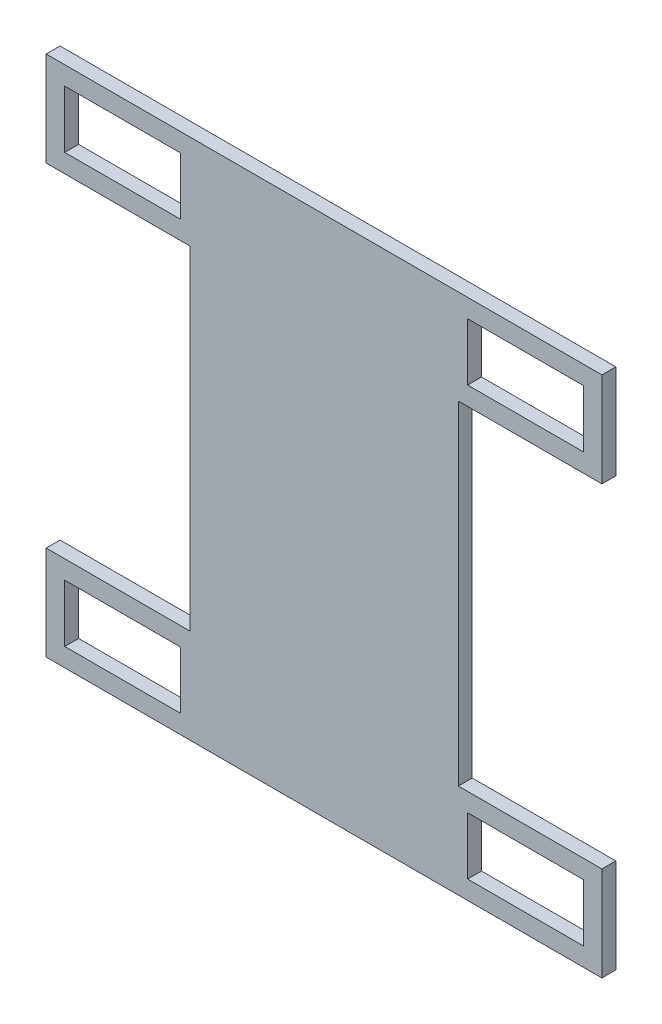
ISO-10303-21;
HEADER;
FILE_DESCRIPTION(('STEP AP214'),'2;1');
FILE_NAME('part.step','',(''),(''),'','','');
FILE_SCHEMA(('AUTOMOTIVE_DESIGN { 1 0 10303 214 1 1 1 1 }'));
ENDSEC;
DATA;
#1=APPLICATION_CONTEXT('core data for automotive mechanical design processes');
#2=APPLICATION_PROTOCOL_DEFINITION('international standard','automotive_design',2000,#1);
#3=PRODUCT_CONTEXT('',#1,'mechanical');
#4=PRODUCT('Part','Part','',(#3));
#5=PRODUCT_RELATED_PRODUCT_CATEGORY('part','',(#4));
#6=PRODUCT_DEFINITION_FORMATION('','',#4);
#7=PRODUCT_DEFINITION_CONTEXT('part definition',#1,'design');
#8=PRODUCT_DEFINITION('design','',#6,#7);
#9=PRODUCT_DEFINITION_SHAPE('','',#8);
#10=(LENGTH_UNIT() NAMED_UNIT(*) SI_UNIT(.MILLI.,.METRE.));
#11=(NAMED_UNIT(*) PLANE_ANGLE_UNIT() SI_UNIT($,.RADIAN.));
#12=(NAMED_UNIT(*) SI_UNIT($,.STERADIAN.) SOLID_ANGLE_UNIT());
#13=UNCERTAINTY_MEASURE_WITH_UNIT(LENGTH_MEASURE(1.E-05),#10,'distance_accuracy_value','');
#14=(GEOMETRIC_REPRESENTATION_CONTEXT(3) GLOBAL_UNCERTAINTY_ASSIGNED_CONTEXT((#13)) GLOBAL_UNIT_ASSIGNED_CONTEXT((#10,
#11,#12)) REPRESENTATION_CONTEXT('',''));
#15=CARTESIAN_POINT('',(0.,0.,0.));
#16=DIRECTION('',(0.,0.,1.));
#17=DIRECTION('',(1.,0.,0.));
#18=AXIS2_PLACEMENT_3D('',#15,#16,#17);
#19=CARTESIAN_POINT('',(0.,0.,3.));
#20=DIRECTION('',(0.,0.,-1.));
#21=DIRECTION('',(-1.,0.,0.));
#22=AXIS2_PLACEMENT_3D('',#19,#20,#21);
#23=PLANE('',#22);
#24=DIRECTION('',(1.,0.,0.));
#25=VECTOR('',#24,1.);
#26=CARTESIAN_POINT('',(-31.,-52.4,3.));
#27=LINE('',#26,#25);
#28=CARTESIAN_POINT('',(-56.,-52.4,3.));
#29=VERTEX_POINT('',#28);
#30=CARTESIAN_POINT('',(-31.,-52.4,3.));
#31=VERTEX_POINT('',#30);
#32=EDGE_CURVE('E256',#29,#31,#27,.T.);
#33=ORIENTED_EDGE('',*,*,#32,.F.);
#34=DIRECTION('',(0.,-1.,0.));
#35=VECTOR('',#34,1.);
#36=CARTESIAN_POINT('',(-56.,-52.4,3.));
#37=LINE('',#36,#35);
#38=CARTESIAN_POINT('',(-56.,-40.,3.));
#39=VERTEX_POINT('',#38);
#40=EDGE_CURVE('E264',#39,#29,#37,.T.);
#41=ORIENTED_EDGE('',*,*,#40,.F.);
#42=DIRECTION('',(-1.,0.,0.));
#43=VECTOR('',#42,1.);
#44=CARTESIAN_POINT('',(-31.,-40.,3.));
#45=LINE('',#44,#43);
#46=CARTESIAN_POINT('',(-31.,-40.,3.));
#47=VERTEX_POINT('',#46);
#48=EDGE_CURVE('E261',#47,#39,#45,.T.);
#49=ORIENTED_EDGE('',*,*,#48,.F.);
#50=DIRECTION('',(0.,1.,0.));
#51=VECTOR('',#50,1.);
#52=CARTESIAN_POINT('',(-31.,-52.4,3.));
#53=LINE('',#52,#51);
#54=EDGE_CURVE('E258',#31,#47,#53,.T.);
#55=ORIENTED_EDGE('',*,*,#54,.F.);
#56=EDGE_LOOP('',(#33,#41,#49,#55));
#57=FACE_BOUND('',#56,.T.);
#58=DIRECTION('',(0.,1.,0.));
#59=VECTOR('',#58,1.);
#60=CARTESIAN_POINT('',(56.,52.4,3.));
#61=LINE('',#60,#59);
#62=CARTESIAN_POINT('',(56.,40.,3.));
#63=VERTEX_POINT('',#62);
#64=CARTESIAN_POINT('',(56.,52.4,3.));
#65=VERTEX_POINT('',#64);
#66=EDGE_CURVE('E318',#63,#65,#61,.T.);
#67=ORIENTED_EDGE('',*,*,#66,.F.);
#68=DIRECTION('',(1.,0.,0.));
#69=VECTOR('',#68,1.);
#70=CARTESIAN_POINT('',(31.,40.,3.));
#71=LINE('',#70,#69);
#72=CARTESIAN_POINT('',(31.,40.,3.));
#73=VERTEX_POINT('',#72);
#74=EDGE_CURVE('E326',#73,#63,#71,.T.);
#75=ORIENTED_EDGE('',*,*,#74,.F.);
#76=DIRECTION('',(0.,-1.,0.));
#77=VECTOR('',#76,1.);
#78=CARTESIAN_POINT('',(31.,52.4,3.));
#79=LINE('',#78,#77);
#80=CARTESIAN_POINT('',(31.,52.4,3.));
#81=VERTEX_POINT('',#80);
#82=EDGE_CURVE('E323',#81,#73,#79,.T.);
#83=ORIENTED_EDGE('',*,*,#82,.F.);
#84=DIRECTION('',(-1.,0.,0.));
#85=VECTOR('',#84,1.);
#86=CARTESIAN_POINT('',(31.,52.4,3.));
#87=LINE('',#86,#85);
#88=EDGE_CURVE('E320',#65,#81,#87,.T.);
#89=ORIENTED_EDGE('',*,*,#88,.F.);
#90=EDGE_LOOP('',(#67,#75,#83,#89));
#91=FACE_BOUND('',#90,.T.);
#92=DIRECTION('',(0.,1.,0.));
#93=VECTOR('',#92,1.);
#94=CARTESIAN_POINT('',(60.,56.4,3.));
#95=LINE('',#94,#93);
#96=CARTESIAN_POINT('',(60.,36.,3.));
#97=VERTEX_POINT('',#96);
#98=CARTESIAN_POINT('',(60.,56.4,3.));
#99=VERTEX_POINT('',#98);
#100=EDGE_CURVE('E349',#97,#99,#95,.T.);
#101=ORIENTED_EDGE('',*,*,#100,.T.);
#102=DIRECTION('',(-1.,0.,0.));
#103=VECTOR('',#102,1.);
#104=CARTESIAN_POINT('',(-60.,56.4,3.));
#105=LINE('',#104,#103);
#106=CARTESIAN_POINT('',(-60.,56.4,3.));
#107=VERTEX_POINT('',#106);
#108=EDGE_CURVE('E352',#99,#107,#105,.T.);
#109=ORIENTED_EDGE('',*,*,#108,.T.);
#110=DIRECTION('',(0.,-1.,0.));
#111=VECTOR('',#110,1.);
#112=CARTESIAN_POINT('',(-60.,56.4,3.));
#113=LINE('',#112,#111);
#114=CARTESIAN_POINT('',(-60.,36.,3.));
#115=VERTEX_POINT('',#114);
#116=EDGE_CURVE('E355',#107,#115,#113,.T.);
#117=ORIENTED_EDGE('',*,*,#116,.T.);
#118=DIRECTION('',(1.,0.,0.));
#119=VECTOR('',#118,1.);
#120=CARTESIAN_POINT('',(-60.,36.,3.));
#121=LINE('',#120,#119);
#122=CARTESIAN_POINT('',(-29.,36.,3.));
#123=VERTEX_POINT('',#122);
#124=EDGE_CURVE('E357',#115,#123,#121,.T.);
#125=ORIENTED_EDGE('',*,*,#124,.T.);
#126=DIRECTION('',(0.,-1.,0.));
#127=VECTOR('',#126,1.);
#128=CARTESIAN_POINT('',(-29.,36.,3.));
#129=LINE('',#128,#127);
#130=CARTESIAN_POINT('',(-29.,-36.,3.));
#131=VERTEX_POINT('',#130);
#132=EDGE_CURVE('E359',#123,#131,#129,.T.);
#133=ORIENTED_EDGE('',*,*,#132,.T.);
#134=DIRECTION('',(-1.,0.,0.));
#135=VECTOR('',#134,1.);
#136=CARTESIAN_POINT('',(-29.,-36.,3.));
#137=LINE('',#136,#135);
#138=CARTESIAN_POINT('',(-60.,-36.,3.));
#139=VERTEX_POINT('',#138);
#140=EDGE_CURVE('E361',#131,#139,#137,.T.);
#141=ORIENTED_EDGE('',*,*,#140,.T.);
#142=DIRECTION('',(0.,-1.,0.));
#143=VECTOR('',#142,1.);
#144=CARTESIAN_POINT('',(-60.,-36.,3.));
#145=LINE('',#144,#143);
#146=CARTESIAN_POINT('',(-60.,-56.4,3.));
#147=VERTEX_POINT('',#146);
#148=EDGE_CURVE('E363',#139,#147,#145,.T.);
#149=ORIENTED_EDGE('',*,*,#148,.T.);
#150=DIRECTION('',(1.,0.,0.));
#151=VECTOR('',#150,1.);
#152=CARTESIAN_POINT('',(60.,-56.4,3.));
#153=LINE('',#152,#151);
#154=CARTESIAN_POINT('',(60.,-56.4,3.));
#155=VERTEX_POINT('',#154);
#156=EDGE_CURVE('E365',#147,#155,#153,.T.);
#157=ORIENTED_EDGE('',*,*,#156,.T.);
#158=DIRECTION('',(0.,1.,0.));
#159=VECTOR('',#158,1.);
#160=CARTESIAN_POINT('',(60.,-36.,3.));
#161=LINE('',#160,#159);
#162=CARTESIAN_POINT('',(60.,-36.,3.));
#163=VERTEX_POINT('',#162);
#164=EDGE_CURVE('E367',#155,#163,#161,.T.);
#165=ORIENTED_EDGE('',*,*,#164,.T.);
#166=DIRECTION('',(-1.,0.,0.));
#167=VECTOR('',#166,1.);
#168=CARTESIAN_POINT('',(29.,-36.,3.));
#169=LINE('',#168,#167);
#170=CARTESIAN_POINT('',(29.,-36.,3.));
#171=VERTEX_POINT('',#170);
#172=EDGE_CURVE('E369',#163,#171,#169,.T.);
#173=ORIENTED_EDGE('',*,*,#172,.T.);
#174=DIRECTION('',(0.,1.,0.));
#175=VECTOR('',#174,1.);
#176=CARTESIAN_POINT('',(29.,36.,3.));
#177=LINE('',#176,#175);
#178=CARTESIAN_POINT('',(29.,36.,3.));
#179=VERTEX_POINT('',#178);
#180=EDGE_CURVE('E371',#171,#179,#177,.T.);
#181=ORIENTED_EDGE('',*,*,#180,.T.);
#182=DIRECTION('',(1.,0.,0.));
#183=VECTOR('',#182,1.);
#184=CARTESIAN_POINT('',(60.,36.,3.));
#185=LINE('',#184,#183);
#186=EDGE_CURVE('E373',#179,#97,#185,.T.);
#187=ORIENTED_EDGE('',*,*,#186,.T.);
#188=EDGE_LOOP('',(#101,#109,#117,#125,#133,#141,#149,#157,#165,#173,#181,#187));
#189=FACE_BOUND('',#188,.T.);
#190=DIRECTION('',(0.,-1.,0.));
#191=VECTOR('',#190,1.);
#192=CARTESIAN_POINT('',(31.,-52.4,3.));
#193=LINE('',#192,#191);
#194=CARTESIAN_POINT('',(31.,-40.,3.));
#195=VERTEX_POINT('',#194);
#196=CARTESIAN_POINT('',(31.,-52.4,3.));
#197=VERTEX_POINT('',#196);
#198=EDGE_CURVE('E287',#195,#197,#193,.T.);
#199=ORIENTED_EDGE('',*,*,#198,.F.);
#200=DIRECTION('',(-1.,0.,0.));
#201=VECTOR('',#200,1.);
#202=CARTESIAN_POINT('',(31.,-40.,3.));
#203=LINE('',#202,#201);
#204=CARTESIAN_POINT('',(56.,-40.,3.));
#205=VERTEX_POINT('',#204);
#206=EDGE_CURVE('E295',#205,#195,#203,.T.);
#207=ORIENTED_EDGE('',*,*,#206,.F.);
#208=DIRECTION('',(0.,1.,0.));
#209=VECTOR('',#208,1.);
#210=CARTESIAN_POINT('',(56.,-52.4,3.));
#211=LINE('',#210,#209);
#212=CARTESIAN_POINT('',(56.,-52.4,3.));
#213=VERTEX_POINT('',#212);
#214=EDGE_CURVE('E292',#213,#205,#211,.T.);
#215=ORIENTED_EDGE('',*,*,#214,.F.);
#216=DIRECTION('',(1.,0.,0.));
#217=VECTOR('',#216,1.);
#218=CARTESIAN_POINT('',(31.,-52.4,3.));
#219=LINE('',#218,#217);
#220=EDGE_CURVE('E289',#197,#213,#219,.T.);
#221=ORIENTED_EDGE('',*,*,#220,.F.);
#222=EDGE_LOOP('',(#199,#207,#215,#221));
#223=FACE_BOUND('',#222,.T.);
#224=DIRECTION('',(0.,1.,0.));
#225=VECTOR('',#224,1.);
#226=CARTESIAN_POINT('',(-31.,52.4,3.));
#227=LINE('',#226,#225);
#228=CARTESIAN_POINT('',(-31.,40.,3.));
#229=VERTEX_POINT('',#228);
#230=CARTESIAN_POINT('',(-31.,52.4,3.));
#231=VERTEX_POINT('',#230);
#232=EDGE_CURVE('E220',#229,#231,#227,.T.);
#233=ORIENTED_EDGE('',*,*,#232,.F.);
#234=DIRECTION('',(1.,0.,0.));
#235=VECTOR('',#234,1.);
#236=CARTESIAN_POINT('',(-31.,40.,3.));
#237=LINE('',#236,#235);
#238=CARTESIAN_POINT('',(-56.,40.,3.));
#239=VERTEX_POINT('',#238);
#240=EDGE_CURVE('E242',#239,#229,#237,.T.);
#241=ORIENTED_EDGE('',*,*,#240,.F.);
#242=DIRECTION('',(0.,-1.,0.));
#243=VECTOR('',#242,1.);
#244=CARTESIAN_POINT('',(-56.,52.4,3.));
#245=LINE('',#244,#243);
#246=CARTESIAN_POINT('',(-56.,52.4,3.));
#247=VERTEX_POINT('',#246);
#248=EDGE_CURVE('E240',#247,#239,#245,.T.);
#249=ORIENTED_EDGE('',*,*,#248,.F.);
#250=DIRECTION('',(-1.,0.,0.));
#251=VECTOR('',#250,1.);
#252=CARTESIAN_POINT('',(-31.,52.4,3.));
#253=LINE('',#252,#251);
#254=EDGE_CURVE('E228',#231,#247,#253,.T.);
#255=ORIENTED_EDGE('',*,*,#254,.F.);
#256=EDGE_LOOP('',(#233,#241,#249,#255));
#257=FACE_BOUND('',#256,.T.);
#258=ADVANCED_FACE('F35',(#57,#91,#189,#223,#257),#23,.F.);
#259=CARTESIAN_POINT('',(0.,0.,0.));
#260=DIRECTION('',(0.,0.,-1.));
#261=DIRECTION('',(-1.,0.,0.));
#262=AXIS2_PLACEMENT_3D('',#259,#260,#261);
#263=PLANE('',#262);
#264=DIRECTION('',(0.,1.,0.));
#265=VECTOR('',#264,1.);
#266=CARTESIAN_POINT('',(60.,56.4,0.));
#267=LINE('',#266,#265);
#268=CARTESIAN_POINT('',(60.,36.,0.));
#269=VERTEX_POINT('',#268);
#270=CARTESIAN_POINT('',(60.,56.4,0.));
#271=VERTEX_POINT('',#270);
#272=EDGE_CURVE('E348',#269,#271,#267,.T.);
#273=ORIENTED_EDGE('',*,*,#272,.F.);
#274=DIRECTION('',(1.,0.,0.));
#275=VECTOR('',#274,1.);
#276=CARTESIAN_POINT('',(60.,36.,0.));
#277=LINE('',#276,#275);
#278=CARTESIAN_POINT('',(29.,36.,0.));
#279=VERTEX_POINT('',#278);
#280=EDGE_CURVE('E353',#279,#269,#277,.T.);
#281=ORIENTED_EDGE('',*,*,#280,.F.);
#282=DIRECTION('',(0.,1.,0.));
#283=VECTOR('',#282,1.);
#284=CARTESIAN_POINT('',(29.,36.,0.));
#285=LINE('',#284,#283);
#286=CARTESIAN_POINT('',(29.,-36.,0.));
#287=VERTEX_POINT('',#286);
#288=EDGE_CURVE('E396',#287,#279,#285,.T.);
#289=ORIENTED_EDGE('',*,*,#288,.F.);
#290=DIRECTION('',(-1.,0.,0.));
#291=VECTOR('',#290,1.);
#292=CARTESIAN_POINT('',(29.,-36.,0.));
#293=LINE('',#292,#291);
#294=CARTESIAN_POINT('',(60.,-36.,0.));
#295=VERTEX_POINT('',#294);
#296=EDGE_CURVE('E394',#295,#287,#293,.T.);
#297=ORIENTED_EDGE('',*,*,#296,.F.);
#298=DIRECTION('',(0.,1.,0.));
#299=VECTOR('',#298,1.);
#300=CARTESIAN_POINT('',(60.,-36.,0.));
#301=LINE('',#300,#299);
#302=CARTESIAN_POINT('',(60.,-56.4,0.));
#303=VERTEX_POINT('',#302);
#304=EDGE_CURVE('E392',#303,#295,#301,.T.);
#305=ORIENTED_EDGE('',*,*,#304,.F.);
#306=DIRECTION('',(1.,0.,0.));
#307=VECTOR('',#306,1.);
#308=CARTESIAN_POINT('',(60.,-56.4,0.));
#309=LINE('',#308,#307);
#310=CARTESIAN_POINT('',(-60.,-56.4,0.));
#311=VERTEX_POINT('',#310);
#312=EDGE_CURVE('E390',#311,#303,#309,.T.);
#313=ORIENTED_EDGE('',*,*,#312,.F.);
#314=DIRECTION('',(0.,-1.,0.));
#315=VECTOR('',#314,1.);
#316=CARTESIAN_POINT('',(-60.,-36.,0.));
#317=LINE('',#316,#315);
#318=CARTESIAN_POINT('',(-60.,-36.,0.));
#319=VERTEX_POINT('',#318);
#320=EDGE_CURVE('E388',#319,#311,#317,.T.);
#321=ORIENTED_EDGE('',*,*,#320,.F.);
#322=DIRECTION('',(-1.,0.,0.));
#323=VECTOR('',#322,1.);
#324=CARTESIAN_POINT('',(-29.,-36.,0.));
#325=LINE('',#324,#323);
#326=CARTESIAN_POINT('',(-29.,-36.,0.));
#327=VERTEX_POINT('',#326);
#328=EDGE_CURVE('E386',#327,#319,#325,.T.);
#329=ORIENTED_EDGE('',*,*,#328,.F.);
#330=DIRECTION('',(0.,-1.,0.));
#331=VECTOR('',#330,1.);
#332=CARTESIAN_POINT('',(-29.,36.,0.));
#333=LINE('',#332,#331);
#334=CARTESIAN_POINT('',(-29.,36.,0.));
#335=VERTEX_POINT('',#334);
#336=EDGE_CURVE('E384',#335,#327,#333,.T.);
#337=ORIENTED_EDGE('',*,*,#336,.F.);
#338=DIRECTION('',(1.,0.,0.));
#339=VECTOR('',#338,1.);
#340=CARTESIAN_POINT('',(-60.,36.,0.));
#341=LINE('',#340,#339);
#342=CARTESIAN_POINT('',(-60.,36.,0.));
#343=VERTEX_POINT('',#342);
#344=EDGE_CURVE('E382',#343,#335,#341,.T.);
#345=ORIENTED_EDGE('',*,*,#344,.F.);
#346=DIRECTION('',(0.,-1.,0.));
#347=VECTOR('',#346,1.);
#348=CARTESIAN_POINT('',(-60.,56.4,0.));
#349=LINE('',#348,#347);
#350=CARTESIAN_POINT('',(-60.,56.4,0.));
#351=VERTEX_POINT('',#350);
#352=EDGE_CURVE('E380',#351,#343,#349,.T.);
#353=ORIENTED_EDGE('',*,*,#352,.F.);
#354=DIRECTION('',(-1.,0.,0.));
#355=VECTOR('',#354,1.);
#356=CARTESIAN_POINT('',(-60.,56.4,0.));
#357=LINE('',#356,#355);
#358=EDGE_CURVE('E378',#271,#351,#357,.T.);
#359=ORIENTED_EDGE('',*,*,#358,.F.);
#360=EDGE_LOOP('',(#273,#281,#289,#297,#305,#313,#321,#329,#337,#345,#353,#359));
#361=FACE_BOUND('',#360,.T.);
#362=DIRECTION('',(1.,0.,0.));
#363=VECTOR('',#362,1.);
#364=CARTESIAN_POINT('',(31.,40.,0.));
#365=LINE('',#364,#363);
#366=CARTESIAN_POINT('',(31.,40.,0.));
#367=VERTEX_POINT('',#366);
#368=CARTESIAN_POINT('',(56.,40.,0.));
#369=VERTEX_POINT('',#368);
#370=EDGE_CURVE('E321',#367,#369,#365,.T.);
#371=ORIENTED_EDGE('',*,*,#370,.T.);
#372=DIRECTION('',(0.,1.,0.));
#373=VECTOR('',#372,1.);
#374=CARTESIAN_POINT('',(56.,52.4,0.));
#375=LINE('',#374,#373);
#376=CARTESIAN_POINT('',(56.,52.4,0.));
#377=VERTEX_POINT('',#376);
#378=EDGE_CURVE('E317',#369,#377,#375,.T.);
#379=ORIENTED_EDGE('',*,*,#378,.T.);
#380=DIRECTION('',(-1.,0.,0.));
#381=VECTOR('',#380,1.);
#382=CARTESIAN_POINT('',(31.,52.4,0.));
#383=LINE('',#382,#381);
#384=CARTESIAN_POINT('',(31.,52.4,0.));
#385=VERTEX_POINT('',#384);
#386=EDGE_CURVE('E331',#377,#385,#383,.T.);
#387=ORIENTED_EDGE('',*,*,#386,.T.);
#388=DIRECTION('',(0.,-1.,0.));
#389=VECTOR('',#388,1.);
#390=CARTESIAN_POINT('',(31.,52.4,0.));
#391=LINE('',#390,#389);
#392=EDGE_CURVE('E334',#385,#367,#391,.T.);
#393=ORIENTED_EDGE('',*,*,#392,.T.);
#394=EDGE_LOOP('',(#371,#379,#387,#393));
#395=FACE_BOUND('',#394,.T.);
#396=DIRECTION('',(-1.,0.,0.));
#397=VECTOR('',#396,1.);
#398=CARTESIAN_POINT('',(31.,-40.,0.));
#399=LINE('',#398,#397);
#400=CARTESIAN_POINT('',(56.,-40.,0.));
#401=VERTEX_POINT('',#400);
#402=CARTESIAN_POINT('',(31.,-40.,0.));
#403=VERTEX_POINT('',#402);
#404=EDGE_CURVE('E290',#401,#403,#399,.T.);
#405=ORIENTED_EDGE('',*,*,#404,.T.);
#406=DIRECTION('',(0.,-1.,0.));
#407=VECTOR('',#406,1.);
#408=CARTESIAN_POINT('',(31.,-52.4,0.));
#409=LINE('',#408,#407);
#410=CARTESIAN_POINT('',(31.,-52.4,0.));
#411=VERTEX_POINT('',#410);
#412=EDGE_CURVE('E286',#403,#411,#409,.T.);
#413=ORIENTED_EDGE('',*,*,#412,.T.);
#414=DIRECTION('',(1.,0.,0.));
#415=VECTOR('',#414,1.);
#416=CARTESIAN_POINT('',(31.,-52.4,0.));
#417=LINE('',#416,#415);
#418=CARTESIAN_POINT('',(56.,-52.4,0.));
#419=VERTEX_POINT('',#418);
#420=EDGE_CURVE('E300',#411,#419,#417,.T.);
#421=ORIENTED_EDGE('',*,*,#420,.T.);
#422=DIRECTION('',(0.,1.,0.));
#423=VECTOR('',#422,1.);
#424=CARTESIAN_POINT('',(56.,-52.4,0.));
#425=LINE('',#424,#423);
#426=EDGE_CURVE('E303',#419,#401,#425,.T.);
#427=ORIENTED_EDGE('',*,*,#426,.T.);
#428=EDGE_LOOP('',(#405,#413,#421,#427));
#429=FACE_BOUND('',#428,.T.);
#430=DIRECTION('',(0.,-1.,0.));
#431=VECTOR('',#430,1.);
#432=CARTESIAN_POINT('',(-56.,-52.4,0.));
#433=LINE('',#432,#431);
#434=CARTESIAN_POINT('',(-56.,-40.,0.));
#435=VERTEX_POINT('',#434);
#436=CARTESIAN_POINT('',(-56.,-52.4,0.));
#437=VERTEX_POINT('',#436);
#438=EDGE_CURVE('E259',#435,#437,#433,.T.);
#439=ORIENTED_EDGE('',*,*,#438,.T.);
#440=DIRECTION('',(1.,0.,0.));
#441=VECTOR('',#440,1.);
#442=CARTESIAN_POINT('',(-31.,-52.4,0.));
#443=LINE('',#442,#441);
#444=CARTESIAN_POINT('',(-31.,-52.4,0.));
#445=VERTEX_POINT('',#444);
#446=EDGE_CURVE('E236',#437,#445,#443,.T.);
#447=ORIENTED_EDGE('',*,*,#446,.T.);
#448=DIRECTION('',(0.,1.,0.));
#449=VECTOR('',#448,1.);
#450=CARTESIAN_POINT('',(-31.,-52.4,0.));
#451=LINE('',#450,#449);
#452=CARTESIAN_POINT('',(-31.,-40.,0.));
#453=VERTEX_POINT('',#452);
#454=EDGE_CURVE('E269',#445,#453,#451,.T.);
#455=ORIENTED_EDGE('',*,*,#454,.T.);
#456=DIRECTION('',(-1.,0.,0.));
#457=VECTOR('',#456,1.);
#458=CARTESIAN_POINT('',(-31.,-40.,0.));
#459=LINE('',#458,#457);
#460=EDGE_CURVE('E272',#453,#435,#459,.T.);
#461=ORIENTED_EDGE('',*,*,#460,.T.);
#462=EDGE_LOOP('',(#439,#447,#455,#461));
#463=FACE_BOUND('',#462,.T.);
#464=DIRECTION('',(1.,0.,0.));
#465=VECTOR('',#464,1.);
#466=CARTESIAN_POINT('',(-31.,40.,0.));
#467=LINE('',#466,#465);
#468=CARTESIAN_POINT('',(-56.,40.,0.));
#469=VERTEX_POINT('',#468);
#470=CARTESIAN_POINT('',(-31.,40.,0.));
#471=VERTEX_POINT('',#470);
#472=EDGE_CURVE('E229',#469,#471,#467,.T.);
#473=ORIENTED_EDGE('',*,*,#472,.T.);
#474=DIRECTION('',(0.,1.,0.));
#475=VECTOR('',#474,1.);
#476=CARTESIAN_POINT('',(-31.,52.4,0.));
#477=LINE('',#476,#475);
#478=CARTESIAN_POINT('',(-31.,52.4,0.));
#479=VERTEX_POINT('',#478);
#480=EDGE_CURVE('E58',#471,#479,#477,.T.);
#481=ORIENTED_EDGE('',*,*,#480,.T.);
#482=DIRECTION('',(-1.,0.,0.));
#483=VECTOR('',#482,1.);
#484=CARTESIAN_POINT('',(-31.,52.4,0.));
#485=LINE('',#484,#483);
#486=CARTESIAN_POINT('',(-56.,52.4,0.));
#487=VERTEX_POINT('',#486);
#488=EDGE_CURVE('E235',#479,#487,#485,.T.);
#489=ORIENTED_EDGE('',*,*,#488,.T.);
#490=DIRECTION('',(0.,-1.,0.));
#491=VECTOR('',#490,1.);
#492=CARTESIAN_POINT('',(-56.,52.4,0.));
#493=LINE('',#492,#491);
#494=EDGE_CURVE('E248',#487,#469,#493,.T.);
#495=ORIENTED_EDGE('',*,*,#494,.T.);
#496=EDGE_LOOP('',(#473,#481,#489,#495));
#497=FACE_BOUND('',#496,.T.);
#498=ADVANCED_FACE('F438',(#361,#395,#429,#463,#497),#263,.T.);
#499=CARTESIAN_POINT('',(60.,56.4,3.));
#500=DIRECTION('',(-1.,0.,0.));
#501=DIRECTION('',(0.,0.,1.));
#502=AXIS2_PLACEMENT_3D('',#499,#500,#501);
#503=PLANE('',#502);
#504=ORIENTED_EDGE('',*,*,#272,.T.);
#505=DIRECTION('',(0.,0.,-1.));
#506=VECTOR('',#505,1.);
#507=CARTESIAN_POINT('',(60.,56.4,3.));
#508=LINE('',#507,#506);
#509=EDGE_CURVE('E11',#99,#271,#508,.T.);
#510=ORIENTED_EDGE('',*,*,#509,.F.);
#511=ORIENTED_EDGE('',*,*,#100,.F.);
#512=DIRECTION('',(0.,0.,-1.));
#513=VECTOR('',#512,1.);
#514=CARTESIAN_POINT('',(60.,36.,3.));
#515=LINE('',#514,#513);
#516=EDGE_CURVE('E375',#97,#269,#515,.T.);
#517=ORIENTED_EDGE('',*,*,#516,.T.);
#518=EDGE_LOOP('',(#504,#510,#511,#517));
#519=FACE_BOUND('',#518,.T.);
#520=ADVANCED_FACE('F37',(#519),#503,.F.);
#521=CARTESIAN_POINT('',(-60.,56.4,3.));
#522=DIRECTION('',(0.,-1.,0.));
#523=DIRECTION('',(0.,0.,-1.));
#524=AXIS2_PLACEMENT_3D('',#521,#522,#523);
#525=PLANE('',#524);
#526=ORIENTED_EDGE('',*,*,#358,.T.);
#527=DIRECTION('',(0.,0.,-1.));
#528=VECTOR('',#527,1.);
#529=CARTESIAN_POINT('',(-60.,56.4,3.));
#530=LINE('',#529,#528);
#531=EDGE_CURVE('E43',#107,#351,#530,.T.);
#532=ORIENTED_EDGE('',*,*,#531,.F.);
#533=ORIENTED_EDGE('',*,*,#108,.F.);
#534=ORIENTED_EDGE('',*,*,#509,.T.);
#535=EDGE_LOOP('',(#526,#532,#533,#534));
#536=FACE_BOUND('',#535,.T.);
#537=ADVANCED_FACE('F456',(#536),#525,.F.);
#538=CARTESIAN_POINT('',(-60.,56.4,3.));
#539=DIRECTION('',(1.,0.,0.));
#540=DIRECTION('',(0.,0.,-1.));
#541=AXIS2_PLACEMENT_3D('',#538,#539,#540);
#542=PLANE('',#541);
#543=ORIENTED_EDGE('',*,*,#352,.T.);
#544=DIRECTION('',(0.,0.,-1.));
#545=VECTOR('',#544,1.);
#546=CARTESIAN_POINT('',(-60.,36.,3.));
#547=LINE('',#546,#545);
#548=EDGE_CURVE('E425',#115,#343,#547,.T.);
#549=ORIENTED_EDGE('',*,*,#548,.F.);
#550=ORIENTED_EDGE('',*,*,#116,.F.);
#551=ORIENTED_EDGE('',*,*,#531,.T.);
#552=EDGE_LOOP('',(#543,#549,#550,#551));
#553=FACE_BOUND('',#552,.T.);
#554=ADVANCED_FACE('F432',(#553),#542,.F.);
#555=CARTESIAN_POINT('',(-60.,36.,3.));
#556=DIRECTION('',(0.,1.,0.));
#557=DIRECTION('',(0.,0.,1.));
#558=AXIS2_PLACEMENT_3D('',#555,#556,#557);
#559=PLANE('',#558);
#560=ORIENTED_EDGE('',*,*,#344,.T.);
#561=DIRECTION('',(0.,0.,-1.));
#562=VECTOR('',#561,1.);
#563=CARTESIAN_POINT('',(-29.,36.,3.));
#564=LINE('',#563,#562);
#565=EDGE_CURVE('E422',#123,#335,#564,.T.);
#566=ORIENTED_EDGE('',*,*,#565,.F.);
#567=ORIENTED_EDGE('',*,*,#124,.F.);
#568=ORIENTED_EDGE('',*,*,#548,.T.);
#569=EDGE_LOOP('',(#560,#566,#567,#568));
#570=FACE_BOUND('',#569,.T.);
#571=ADVANCED_FACE('F444',(#570),#559,.F.);
#572=CARTESIAN_POINT('',(-29.,36.,3.));
#573=DIRECTION('',(1.,0.,0.));
#574=DIRECTION('',(0.,1.,0.));
#575=AXIS2_PLACEMENT_3D('',#572,#573,#574);
#576=PLANE('',#575);
#577=ORIENTED_EDGE('',*,*,#336,.T.);
#578=DIRECTION('',(0.,0.,-1.));
#579=VECTOR('',#578,1.);
#580=CARTESIAN_POINT('',(-29.,-36.,3.));
#581=LINE('',#580,#579);
#582=EDGE_CURVE('E419',#131,#327,#581,.T.);
#583=ORIENTED_EDGE('',*,*,#582,.F.);
#584=ORIENTED_EDGE('',*,*,#132,.F.);
#585=ORIENTED_EDGE('',*,*,#565,.T.);
#586=EDGE_LOOP('',(#577,#583,#584,#585));
#587=FACE_BOUND('',#586,.T.);
#588=ADVANCED_FACE('F448',(#587),#576,.F.);
#589=CARTESIAN_POINT('',(-29.,-36.,3.));
#590=DIRECTION('',(0.,-1.,0.));
#591=DIRECTION('',(0.,0.,-1.));
#592=AXIS2_PLACEMENT_3D('',#589,#590,#591);
#593=PLANE('',#592);
#594=ORIENTED_EDGE('',*,*,#328,.T.);
#595=DIRECTION('',(0.,0.,-1.));
#596=VECTOR('',#595,1.);
#597=CARTESIAN_POINT('',(-60.,-36.,3.));
#598=LINE('',#597,#596);
#599=EDGE_CURVE('E416',#139,#319,#598,.T.);
#600=ORIENTED_EDGE('',*,*,#599,.F.);
#601=ORIENTED_EDGE('',*,*,#140,.F.);
#602=ORIENTED_EDGE('',*,*,#582,.T.);
#603=EDGE_LOOP('',(#594,#600,#601,#602));
#604=FACE_BOUND('',#603,.T.);
#605=ADVANCED_FACE('F489',(#604),#593,.F.);
#606=CARTESIAN_POINT('',(-60.,-36.,3.));
#607=DIRECTION('',(1.,0.,0.));
#608=DIRECTION('',(0.,1.,0.));
#609=AXIS2_PLACEMENT_3D('',#606,#607,#608);
#610=PLANE('',#609);
#611=ORIENTED_EDGE('',*,*,#320,.T.);
#612=DIRECTION('',(0.,0.,-1.));
#613=VECTOR('',#612,1.);
#614=CARTESIAN_POINT('',(-60.,-56.4,3.));
#615=LINE('',#614,#613);
#616=EDGE_CURVE('E413',#147,#311,#615,.T.);
#617=ORIENTED_EDGE('',*,*,#616,.F.);
#618=ORIENTED_EDGE('',*,*,#148,.F.);
#619=ORIENTED_EDGE('',*,*,#599,.T.);
#620=EDGE_LOOP('',(#611,#617,#618,#619));
#621=FACE_BOUND('',#620,.T.);
#622=ADVANCED_FACE('F487',(#621),#610,.F.);
#623=CARTESIAN_POINT('',(60.,-56.4,3.));
#624=DIRECTION('',(0.,1.,0.));
#625=DIRECTION('',(0.,0.,1.));
#626=AXIS2_PLACEMENT_3D('',#623,#624,#625);
#627=PLANE('',#626);
#628=ORIENTED_EDGE('',*,*,#312,.T.);
#629=DIRECTION('',(0.,0.,-1.));
#630=VECTOR('',#629,1.);
#631=CARTESIAN_POINT('',(60.,-56.4,3.));
#632=LINE('',#631,#630);
#633=EDGE_CURVE('E410',#155,#303,#632,.T.);
#634=ORIENTED_EDGE('',*,*,#633,.F.);
#635=ORIENTED_EDGE('',*,*,#156,.F.);
#636=ORIENTED_EDGE('',*,*,#616,.T.);
#637=EDGE_LOOP('',(#628,#634,#635,#636));
#638=FACE_BOUND('',#637,.T.);
#639=ADVANCED_FACE('F483',(#638),#627,.F.);
#640=CARTESIAN_POINT('',(60.,-36.,3.));
#641=DIRECTION('',(-1.,0.,0.));
#642=DIRECTION('',(0.,-1.,0.));
#643=AXIS2_PLACEMENT_3D('',#640,#641,#642);
#644=PLANE('',#643);
#645=ORIENTED_EDGE('',*,*,#304,.T.);
#646=DIRECTION('',(0.,0.,-1.));
#647=VECTOR('',#646,1.);
#648=CARTESIAN_POINT('',(60.,-36.,3.));
#649=LINE('',#648,#647);
#650=EDGE_CURVE('E407',#163,#295,#649,.T.);
#651=ORIENTED_EDGE('',*,*,#650,.F.);
#652=ORIENTED_EDGE('',*,*,#164,.F.);
#653=ORIENTED_EDGE('',*,*,#633,.T.);
#654=EDGE_LOOP('',(#645,#651,#652,#653));
#655=FACE_BOUND('',#654,.T.);
#656=ADVANCED_FACE('F478',(#655),#644,.F.);
#657=CARTESIAN_POINT('',(29.,-36.,3.));
#658=DIRECTION('',(0.,-1.,0.));
#659=DIRECTION('',(0.,0.,-1.));
#660=AXIS2_PLACEMENT_3D('',#657,#658,#659);
#661=PLANE('',#660);
#662=ORIENTED_EDGE('',*,*,#296,.T.);
#663=DIRECTION('',(0.,0.,-1.));
#664=VECTOR('',#663,1.);
#665=CARTESIAN_POINT('',(29.,-36.,3.));
#666=LINE('',#665,#664);
#667=EDGE_CURVE('E404',#171,#287,#666,.T.);
#668=ORIENTED_EDGE('',*,*,#667,.F.);
#669=ORIENTED_EDGE('',*,*,#172,.F.);
#670=ORIENTED_EDGE('',*,*,#650,.T.);
#671=EDGE_LOOP('',(#662,#668,#669,#670));
#672=FACE_BOUND('',#671,.T.);
#673=ADVANCED_FACE('F472',(#672),#661,.F.);
#674=CARTESIAN_POINT('',(29.,36.,3.));
#675=DIRECTION('',(-1.,0.,0.));
#676=DIRECTION('',(0.,-1.,0.));
#677=AXIS2_PLACEMENT_3D('',#674,#675,#676);
#678=PLANE('',#677);
#679=ORIENTED_EDGE('',*,*,#288,.T.);
#680=DIRECTION('',(0.,0.,-1.));
#681=VECTOR('',#680,1.);
#682=CARTESIAN_POINT('',(29.,36.,3.));
#683=LINE('',#682,#681);
#684=EDGE_CURVE('E401',#179,#279,#683,.T.);
#685=ORIENTED_EDGE('',*,*,#684,.F.);
#686=ORIENTED_EDGE('',*,*,#180,.F.);
#687=ORIENTED_EDGE('',*,*,#667,.T.);
#688=EDGE_LOOP('',(#679,#685,#686,#687));
#689=FACE_BOUND('',#688,.T.);
#690=ADVANCED_FACE('F468',(#689),#678,.F.);
#691=CARTESIAN_POINT('',(60.,36.,3.));
#692=DIRECTION('',(0.,1.,0.));
#693=DIRECTION('',(0.,0.,1.));
#694=AXIS2_PLACEMENT_3D('',#691,#692,#693);
#695=PLANE('',#694);
#696=ORIENTED_EDGE('',*,*,#280,.T.);
#697=ORIENTED_EDGE('',*,*,#516,.F.);
#698=ORIENTED_EDGE('',*,*,#186,.F.);
#699=ORIENTED_EDGE('',*,*,#684,.T.);
#700=EDGE_LOOP('',(#696,#697,#698,#699));
#701=FACE_BOUND('',#700,.T.);
#702=ADVANCED_FACE('F463',(#701),#695,.F.);
#703=CARTESIAN_POINT('',(56.,52.4,3.));
#704=DIRECTION('',(-1.,0.,0.));
#705=DIRECTION('',(0.,0.,1.));
#706=AXIS2_PLACEMENT_3D('',#703,#704,#705);
#707=PLANE('',#706);
#708=ORIENTED_EDGE('',*,*,#378,.F.);
#709=DIRECTION('',(0.,0.,-1.));
#710=VECTOR('',#709,1.);
#711=CARTESIAN_POINT('',(56.,40.,3.));
#712=LINE('',#711,#710);
#713=EDGE_CURVE('E328',#63,#369,#712,.T.);
#714=ORIENTED_EDGE('',*,*,#713,.F.);
#715=ORIENTED_EDGE('',*,*,#66,.T.);
#716=DIRECTION('',(0.,0.,-1.));
#717=VECTOR('',#716,1.);
#718=CARTESIAN_POINT('',(56.,52.4,3.));
#719=LINE('',#718,#717);
#720=EDGE_CURVE('E345',#65,#377,#719,.T.);
#721=ORIENTED_EDGE('',*,*,#720,.T.);
#722=EDGE_LOOP('',(#708,#714,#715,#721));
#723=FACE_BOUND('',#722,.T.);
#724=ADVANCED_FACE('F508',(#723),#707,.T.);
#725=CARTESIAN_POINT('',(31.,52.4,3.));
#726=DIRECTION('',(0.,-1.,0.));
#727=DIRECTION('',(1.,0.,0.));
#728=AXIS2_PLACEMENT_3D('',#725,#726,#727);
#729=PLANE('',#728);
#730=ORIENTED_EDGE('',*,*,#386,.F.);
#731=ORIENTED_EDGE('',*,*,#720,.F.);
#732=ORIENTED_EDGE('',*,*,#88,.T.);
#733=DIRECTION('',(0.,0.,-1.));
#734=VECTOR('',#733,1.);
#735=CARTESIAN_POINT('',(31.,52.4,3.));
#736=LINE('',#735,#734);
#737=EDGE_CURVE('E343',#81,#385,#736,.T.);
#738=ORIENTED_EDGE('',*,*,#737,.T.);
#739=EDGE_LOOP('',(#730,#731,#732,#738));
#740=FACE_BOUND('',#739,.T.);
#741=ADVANCED_FACE('F546',(#740),#729,.T.);
#742=CARTESIAN_POINT('',(31.,52.4,3.));
#743=DIRECTION('',(1.,0.,0.));
#744=DIRECTION('',(0.,1.,0.));
#745=AXIS2_PLACEMENT_3D('',#742,#743,#744);
#746=PLANE('',#745);
#747=ORIENTED_EDGE('',*,*,#392,.F.);
#748=ORIENTED_EDGE('',*,*,#737,.F.);
#749=ORIENTED_EDGE('',*,*,#82,.T.);
#750=DIRECTION('',(0.,0.,-1.));
#751=VECTOR('',#750,1.);
#752=CARTESIAN_POINT('',(31.,40.,3.));
#753=LINE('',#752,#751);
#754=EDGE_CURVE('E341',#73,#367,#753,.T.);
#755=ORIENTED_EDGE('',*,*,#754,.T.);
#756=EDGE_LOOP('',(#747,#748,#749,#755));
#757=FACE_BOUND('',#756,.T.);
#758=ADVANCED_FACE('F553',(#757),#746,.T.);
#759=CARTESIAN_POINT('',(31.,40.,3.));
#760=DIRECTION('',(0.,1.,0.));
#761=DIRECTION('',(0.,0.,1.));
#762=AXIS2_PLACEMENT_3D('',#759,#760,#761);
#763=PLANE('',#762);
#764=ORIENTED_EDGE('',*,*,#370,.F.);
#765=ORIENTED_EDGE('',*,*,#754,.F.);
#766=ORIENTED_EDGE('',*,*,#74,.T.);
#767=ORIENTED_EDGE('',*,*,#713,.T.);
#768=EDGE_LOOP('',(#764,#765,#766,#767));
#769=FACE_BOUND('',#768,.T.);
#770=ADVANCED_FACE('F560',(#769),#763,.T.);
#771=CARTESIAN_POINT('',(31.,-52.4,3.));
#772=DIRECTION('',(1.,0.,0.));
#773=DIRECTION('',(0.,0.,-1.));
#774=AXIS2_PLACEMENT_3D('',#771,#772,#773);
#775=PLANE('',#774);
#776=ORIENTED_EDGE('',*,*,#412,.F.);
#777=DIRECTION('',(0.,0.,-1.));
#778=VECTOR('',#777,1.);
#779=CARTESIAN_POINT('',(31.,-40.,3.));
#780=LINE('',#779,#778);
#781=EDGE_CURVE('E297',#195,#403,#780,.T.);
#782=ORIENTED_EDGE('',*,*,#781,.F.);
#783=ORIENTED_EDGE('',*,*,#198,.T.);
#784=DIRECTION('',(0.,0.,-1.));
#785=VECTOR('',#784,1.);
#786=CARTESIAN_POINT('',(31.,-52.4,3.));
#787=LINE('',#786,#785);
#788=EDGE_CURVE('E314',#197,#411,#787,.T.);
#789=ORIENTED_EDGE('',*,*,#788,.T.);
#790=EDGE_LOOP('',(#776,#782,#783,#789));
#791=FACE_BOUND('',#790,.T.);
#792=ADVANCED_FACE('F568',(#791),#775,.T.);
#793=CARTESIAN_POINT('',(31.,-52.4,3.));
#794=DIRECTION('',(0.,1.,0.));
#795=DIRECTION('',(-1.,0.,0.));
#796=AXIS2_PLACEMENT_3D('',#793,#794,#795);
#797=PLANE('',#796);
#798=ORIENTED_EDGE('',*,*,#420,.F.);
#799=ORIENTED_EDGE('',*,*,#788,.F.);
#800=ORIENTED_EDGE('',*,*,#220,.T.);
#801=DIRECTION('',(0.,0.,-1.));
#802=VECTOR('',#801,1.);
#803=CARTESIAN_POINT('',(56.,-52.4,3.));
#804=LINE('',#803,#802);
#805=EDGE_CURVE('E312',#213,#419,#804,.T.);
#806=ORIENTED_EDGE('',*,*,#805,.T.);
#807=EDGE_LOOP('',(#798,#799,#800,#806));
#808=FACE_BOUND('',#807,.T.);
#809=ADVANCED_FACE('F576',(#808),#797,.T.);
#810=CARTESIAN_POINT('',(56.,-52.4,3.));
#811=DIRECTION('',(-1.,0.,0.));
#812=DIRECTION('',(0.,0.,1.));
#813=AXIS2_PLACEMENT_3D('',#810,#811,#812);
#814=PLANE('',#813);
#815=ORIENTED_EDGE('',*,*,#426,.F.);
#816=ORIENTED_EDGE('',*,*,#805,.F.);
#817=ORIENTED_EDGE('',*,*,#214,.T.);
#818=DIRECTION('',(0.,0.,-1.));
#819=VECTOR('',#818,1.);
#820=CARTESIAN_POINT('',(56.,-40.,3.));
#821=LINE('',#820,#819);
#822=EDGE_CURVE('E310',#205,#401,#821,.T.);
#823=ORIENTED_EDGE('',*,*,#822,.T.);
#824=EDGE_LOOP('',(#815,#816,#817,#823));
#825=FACE_BOUND('',#824,.T.);
#826=ADVANCED_FACE('F584',(#825),#814,.T.);
#827=CARTESIAN_POINT('',(31.,-40.,3.));
#828=DIRECTION('',(0.,-1.,0.));
#829=DIRECTION('',(0.,0.,-1.));
#830=AXIS2_PLACEMENT_3D('',#827,#828,#829);
#831=PLANE('',#830);
#832=ORIENTED_EDGE('',*,*,#404,.F.);
#833=ORIENTED_EDGE('',*,*,#822,.F.);
#834=ORIENTED_EDGE('',*,*,#206,.T.);
#835=ORIENTED_EDGE('',*,*,#781,.T.);
#836=EDGE_LOOP('',(#832,#833,#834,#835));
#837=FACE_BOUND('',#836,.T.);
#838=ADVANCED_FACE('F592',(#837),#831,.T.);
#839=CARTESIAN_POINT('',(-31.,-52.4,3.));
#840=DIRECTION('',(0.,1.,0.));
#841=DIRECTION('',(-1.,0.,0.));
#842=AXIS2_PLACEMENT_3D('',#839,#840,#841);
#843=PLANE('',#842);
#844=ORIENTED_EDGE('',*,*,#446,.F.);
#845=DIRECTION('',(0.,0.,-1.));
#846=VECTOR('',#845,1.);
#847=CARTESIAN_POINT('',(-56.,-52.4,3.));
#848=LINE('',#847,#846);
#849=EDGE_CURVE('E266',#29,#437,#848,.T.);
#850=ORIENTED_EDGE('',*,*,#849,.F.);
#851=ORIENTED_EDGE('',*,*,#32,.T.);
#852=DIRECTION('',(0.,0.,-1.));
#853=VECTOR('',#852,1.);
#854=CARTESIAN_POINT('',(-31.,-52.4,3.));
#855=LINE('',#854,#853);
#856=EDGE_CURVE('E283',#31,#445,#855,.T.);
#857=ORIENTED_EDGE('',*,*,#856,.T.);
#858=EDGE_LOOP('',(#844,#850,#851,#857));
#859=FACE_BOUND('',#858,.T.);
#860=ADVANCED_FACE('F600',(#859),#843,.T.);
#861=CARTESIAN_POINT('',(-31.,-52.4,3.));
#862=DIRECTION('',(-1.,0.,0.));
#863=DIRECTION('',(0.,0.,1.));
#864=AXIS2_PLACEMENT_3D('',#861,#862,#863);
#865=PLANE('',#864);
#866=ORIENTED_EDGE('',*,*,#454,.F.);
#867=ORIENTED_EDGE('',*,*,#856,.F.);
#868=ORIENTED_EDGE('',*,*,#54,.T.);
#869=DIRECTION('',(0.,0.,-1.));
#870=VECTOR('',#869,1.);
#871=CARTESIAN_POINT('',(-31.,-40.,3.));
#872=LINE('',#871,#870);
#873=EDGE_CURVE('E281',#47,#453,#872,.T.);
#874=ORIENTED_EDGE('',*,*,#873,.T.);
#875=EDGE_LOOP('',(#866,#867,#868,#874));
#876=FACE_BOUND('',#875,.T.);
#877=ADVANCED_FACE('F608',(#876),#865,.T.);
#878=CARTESIAN_POINT('',(-31.,-40.,3.));
#879=DIRECTION('',(0.,-1.,0.));
#880=DIRECTION('',(0.,0.,-1.));
#881=AXIS2_PLACEMENT_3D('',#878,#879,#880);
#882=PLANE('',#881);
#883=ORIENTED_EDGE('',*,*,#460,.F.);
#884=ORIENTED_EDGE('',*,*,#873,.F.);
#885=ORIENTED_EDGE('',*,*,#48,.T.);
#886=DIRECTION('',(0.,0.,-1.));
#887=VECTOR('',#886,1.);
#888=CARTESIAN_POINT('',(-56.,-40.,3.));
#889=LINE('',#888,#887);
#890=EDGE_CURVE('E279',#39,#435,#889,.T.);
#891=ORIENTED_EDGE('',*,*,#890,.T.);
#892=EDGE_LOOP('',(#883,#884,#885,#891));
#893=FACE_BOUND('',#892,.T.);
#894=ADVANCED_FACE('F616',(#893),#882,.T.);
#895=CARTESIAN_POINT('',(-56.,-52.4,3.));
#896=DIRECTION('',(1.,0.,0.));
#897=DIRECTION('',(0.,0.,-1.));
#898=AXIS2_PLACEMENT_3D('',#895,#896,#897);
#899=PLANE('',#898);
#900=ORIENTED_EDGE('',*,*,#438,.F.);
#901=ORIENTED_EDGE('',*,*,#890,.F.);
#902=ORIENTED_EDGE('',*,*,#40,.T.);
#903=ORIENTED_EDGE('',*,*,#849,.T.);
#904=EDGE_LOOP('',(#900,#901,#902,#903));
#905=FACE_BOUND('',#904,.T.);
#906=ADVANCED_FACE('F624',(#905),#899,.T.);
#907=CARTESIAN_POINT('',(-31.,52.4,3.));
#908=DIRECTION('',(-1.,0.,0.));
#909=DIRECTION('',(0.,0.,1.));
#910=AXIS2_PLACEMENT_3D('',#907,#908,#909);
#911=PLANE('',#910);
#912=ORIENTED_EDGE('',*,*,#480,.F.);
#913=DIRECTION('',(0.,0.,-1.));
#914=VECTOR('',#913,1.);
#915=CARTESIAN_POINT('',(-31.,40.,3.));
#916=LINE('',#915,#914);
#917=EDGE_CURVE('E224',#229,#471,#916,.T.);
#918=ORIENTED_EDGE('',*,*,#917,.F.);
#919=ORIENTED_EDGE('',*,*,#232,.T.);
#920=DIRECTION('',(0.,0.,-1.));
#921=VECTOR('',#920,1.);
#922=CARTESIAN_POINT('',(-31.,52.4,3.));
#923=LINE('',#922,#921);
#924=EDGE_CURVE('E223',#231,#479,#923,.T.);
#925=ORIENTED_EDGE('',*,*,#924,.T.);
#926=EDGE_LOOP('',(#912,#918,#919,#925));
#927=FACE_BOUND('',#926,.T.);
#928=ADVANCED_FACE('F222',(#927),#911,.T.);
#929=CARTESIAN_POINT('',(-31.,52.4,3.));
#930=DIRECTION('',(0.,-1.,0.));
#931=DIRECTION('',(1.,0.,0.));
#932=AXIS2_PLACEMENT_3D('',#929,#930,#931);
#933=PLANE('',#932);
#934=ORIENTED_EDGE('',*,*,#488,.F.);
#935=ORIENTED_EDGE('',*,*,#924,.F.);
#936=ORIENTED_EDGE('',*,*,#254,.T.);
#937=DIRECTION('',(0.,0.,-1.));
#938=VECTOR('',#937,1.);
#939=CARTESIAN_POINT('',(-56.,52.4,3.));
#940=LINE('',#939,#938);
#941=EDGE_CURVE('E237',#247,#487,#940,.T.);
#942=ORIENTED_EDGE('',*,*,#941,.T.);
#943=EDGE_LOOP('',(#934,#935,#936,#942));
#944=FACE_BOUND('',#943,.T.);
#945=ADVANCED_FACE('F232',(#944),#933,.T.);
#946=CARTESIAN_POINT('',(-56.,52.4,3.));
#947=DIRECTION('',(1.,0.,0.));
#948=DIRECTION('',(0.,0.,-1.));
#949=AXIS2_PLACEMENT_3D('',#946,#947,#948);
#950=PLANE('',#949);
#951=ORIENTED_EDGE('',*,*,#494,.F.);
#952=ORIENTED_EDGE('',*,*,#941,.F.);
#953=ORIENTED_EDGE('',*,*,#248,.T.);
#954=DIRECTION('',(0.,0.,-1.));
#955=VECTOR('',#954,1.);
#956=CARTESIAN_POINT('',(-56.,40.,3.));
#957=LINE('',#956,#955);
#958=EDGE_CURVE('E50',#239,#469,#957,.T.);
#959=ORIENTED_EDGE('',*,*,#958,.T.);
#960=EDGE_LOOP('',(#951,#952,#953,#959));
#961=FACE_BOUND('',#960,.T.);
#962=ADVANCED_FACE('F645',(#961),#950,.T.);
#963=CARTESIAN_POINT('',(-31.,40.,3.));
#964=DIRECTION('',(0.,1.,0.));
#965=DIRECTION('',(0.,0.,1.));
#966=AXIS2_PLACEMENT_3D('',#963,#964,#965);
#967=PLANE('',#966);
#968=ORIENTED_EDGE('',*,*,#472,.F.);
#969=ORIENTED_EDGE('',*,*,#958,.F.);
#970=ORIENTED_EDGE('',*,*,#240,.T.);
#971=ORIENTED_EDGE('',*,*,#917,.T.);
#972=EDGE_LOOP('',(#968,#969,#970,#971));
#973=FACE_BOUND('',#972,.T.);
#974=ADVANCED_FACE('F652',(#973),#967,.T.);
#975=CLOSED_SHELL('',(#258,#498,#520,#537,#554,#571,#588,#605,#622,#639,#656,#673,#690,#702,
#724,#741,#758,#770,#792,#809,#826,#838,#860,#877,#894,#906,#928,#945,#962,#974));
#976=MANIFOLD_SOLID_BREP('B2',#975);
#977=ADVANCED_BREP_SHAPE_REPRESENTATION('',(#18,#976),#14);
#978=SHAPE_DEFINITION_REPRESENTATION(#9,#977);
ENDSEC;
END-ISO-10303-21;
